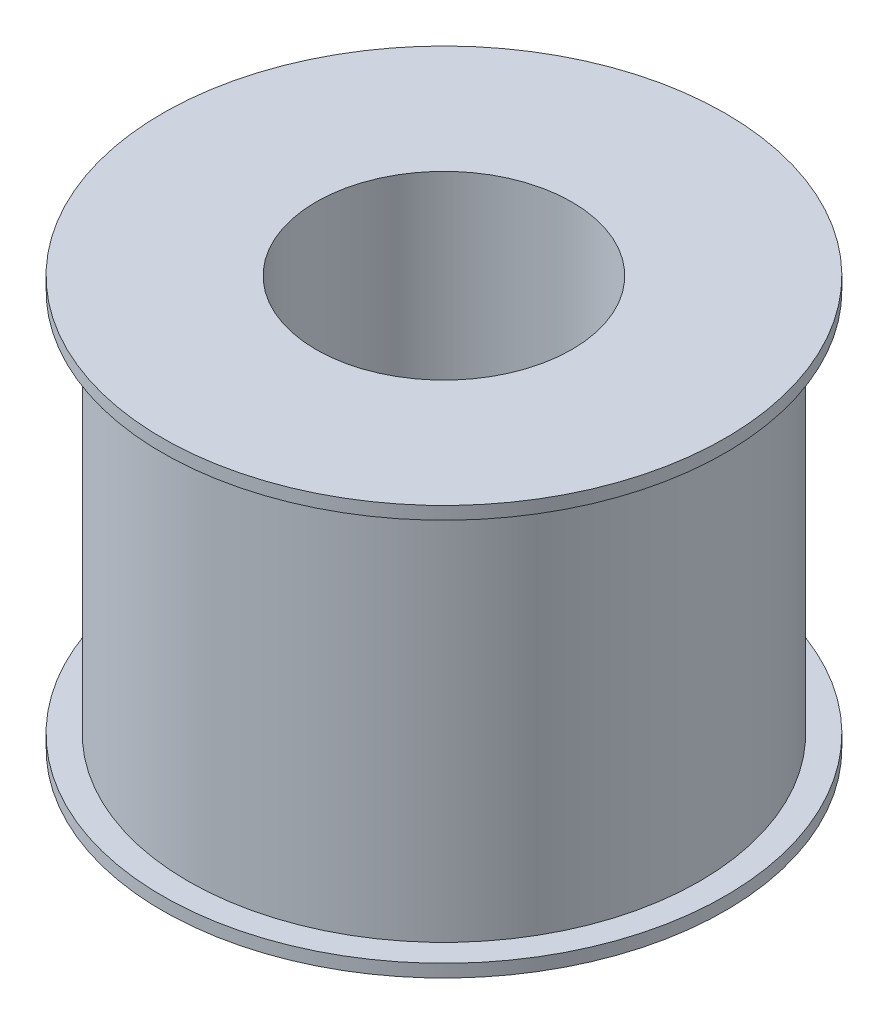
ISO-10303-21;
HEADER;
FILE_DESCRIPTION(('STEP AP214'),'2;1');
FILE_NAME('part.step','',(''),(''),'','','');
FILE_SCHEMA(('AUTOMOTIVE_DESIGN { 1 0 10303 214 1 1 1 1 }'));
ENDSEC;
DATA;
#1=APPLICATION_CONTEXT('core data for automotive mechanical design processes');
#2=APPLICATION_PROTOCOL_DEFINITION('international standard','automotive_design',2000,#1);
#3=PRODUCT_CONTEXT('',#1,'mechanical');
#4=PRODUCT('Part','Part','',(#3));
#5=PRODUCT_RELATED_PRODUCT_CATEGORY('part','',(#4));
#6=PRODUCT_DEFINITION_FORMATION('','',#4);
#7=PRODUCT_DEFINITION_CONTEXT('part definition',#1,'design');
#8=PRODUCT_DEFINITION('design','',#6,#7);
#9=PRODUCT_DEFINITION_SHAPE('','',#8);
#10=(LENGTH_UNIT() NAMED_UNIT(*) SI_UNIT(.MILLI.,.METRE.));
#11=(NAMED_UNIT(*) PLANE_ANGLE_UNIT() SI_UNIT($,.RADIAN.));
#12=(NAMED_UNIT(*) SI_UNIT($,.STERADIAN.) SOLID_ANGLE_UNIT());
#13=UNCERTAINTY_MEASURE_WITH_UNIT(LENGTH_MEASURE(1.E-05),#10,'distance_accuracy_value','');
#14=(GEOMETRIC_REPRESENTATION_CONTEXT(3) GLOBAL_UNCERTAINTY_ASSIGNED_CONTEXT((#13)) GLOBAL_UNIT_ASSIGNED_CONTEXT((#10,
#11,#12)) REPRESENTATION_CONTEXT('',''));
#15=CARTESIAN_POINT('',(0.,0.,0.));
#16=DIRECTION('',(0.,0.,1.));
#17=DIRECTION('',(1.,0.,0.));
#18=AXIS2_PLACEMENT_3D('',#15,#16,#17);
#19=CARTESIAN_POINT('',(0.,0.,0.));
#20=DIRECTION('',(0.,-1.,0.));
#21=DIRECTION('',(0.,0.,-1.));
#22=AXIS2_PLACEMENT_3D('',#19,#20,#21);
#23=CYLINDRICAL_SURFACE('',#22,5.);
#24=CARTESIAN_POINT('',(0.,0.544117647058821,0.));
#25=DIRECTION('',(0.,-1.,0.));
#26=DIRECTION('',(0.,0.,-1.));
#27=AXIS2_PLACEMENT_3D('',#24,#25,#26);
#28=CIRCLE('',#27,5.);
#29=CARTESIAN_POINT('',(0.,0.544117647058821,-5.));
#30=VERTEX_POINT('',#29);
#31=EDGE_CURVE('E64',#30,#30,#28,.T.);
#32=ORIENTED_EDGE('',*,*,#31,.T.);
#33=EDGE_LOOP('',(#32));
#34=FACE_BOUND('',#33,.T.);
#35=CARTESIAN_POINT('',(0.,16.5441176470588,0.));
#36=DIRECTION('',(0.,-1.,0.));
#37=DIRECTION('',(0.,0.,-1.));
#38=AXIS2_PLACEMENT_3D('',#35,#36,#37);
#39=CIRCLE('',#38,5.);
#40=CARTESIAN_POINT('',(0.,16.5441176470588,-5.));
#41=VERTEX_POINT('',#40);
#42=EDGE_CURVE('E10',#41,#41,#39,.T.);
#43=ORIENTED_EDGE('',*,*,#42,.F.);
#44=EDGE_LOOP('',(#43));
#45=FACE_BOUND('',#44,.T.);
#46=ADVANCED_FACE('F36',(#34,#45),#23,.F.);
#47=CARTESIAN_POINT('',(5.,16.5441176470588,0.));
#48=DIRECTION('',(0.,1.,0.));
#49=DIRECTION('',(0.,0.,1.));
#50=AXIS2_PLACEMENT_3D('',#47,#48,#49);
#51=PLANE('',#50);
#52=ORIENTED_EDGE('',*,*,#42,.T.);
#53=EDGE_LOOP('',(#52));
#54=FACE_BOUND('',#53,.T.);
#55=CARTESIAN_POINT('',(0.,16.5441176470588,0.));
#56=DIRECTION('',(0.,-1.,0.));
#57=DIRECTION('',(0.,0.,-1.));
#58=AXIS2_PLACEMENT_3D('',#55,#56,#57);
#59=CIRCLE('',#58,11.);
#60=CARTESIAN_POINT('',(0.,16.5441176470588,-11.));
#61=VERTEX_POINT('',#60);
#62=EDGE_CURVE('E42',#61,#61,#59,.T.);
#63=ORIENTED_EDGE('',*,*,#62,.F.);
#64=EDGE_LOOP('',(#63));
#65=FACE_BOUND('',#64,.T.);
#66=ADVANCED_FACE('F82',(#54,#65),#51,.T.);
#67=CARTESIAN_POINT('',(0.,0.,0.));
#68=DIRECTION('',(0.,-1.,0.));
#69=DIRECTION('',(0.,0.,-1.));
#70=AXIS2_PLACEMENT_3D('',#67,#68,#69);
#71=CYLINDRICAL_SURFACE('',#70,11.);
#72=ORIENTED_EDGE('',*,*,#62,.T.);
#73=EDGE_LOOP('',(#72));
#74=FACE_BOUND('',#73,.T.);
#75=CARTESIAN_POINT('',(0.,16.0441176470588,0.));
#76=DIRECTION('',(0.,-1.,0.));
#77=DIRECTION('',(0.,0.,-1.));
#78=AXIS2_PLACEMENT_3D('',#75,#76,#77);
#79=CIRCLE('',#78,11.);
#80=CARTESIAN_POINT('',(0.,16.0441176470588,-11.));
#81=VERTEX_POINT('',#80);
#82=EDGE_CURVE('E46',#81,#81,#79,.T.);
#83=ORIENTED_EDGE('',*,*,#82,.F.);
#84=EDGE_LOOP('',(#83));
#85=FACE_BOUND('',#84,.T.);
#86=ADVANCED_FACE('F86',(#74,#85),#71,.T.);
#87=CARTESIAN_POINT('',(11.,16.0441176470588,0.));
#88=DIRECTION('',(0.,-1.,0.));
#89=DIRECTION('',(0.,0.,-1.));
#90=AXIS2_PLACEMENT_3D('',#87,#88,#89);
#91=PLANE('',#90);
#92=ORIENTED_EDGE('',*,*,#82,.T.);
#93=EDGE_LOOP('',(#92));
#94=FACE_BOUND('',#93,.T.);
#95=CARTESIAN_POINT('',(0.,16.0441176470588,0.));
#96=DIRECTION('',(0.,-1.,0.));
#97=DIRECTION('',(0.,0.,-1.));
#98=AXIS2_PLACEMENT_3D('',#95,#96,#97);
#99=CIRCLE('',#98,10.);
#100=CARTESIAN_POINT('',(0.,16.0441176470588,-10.));
#101=VERTEX_POINT('',#100);
#102=EDGE_CURVE('E50',#101,#101,#99,.T.);
#103=ORIENTED_EDGE('',*,*,#102,.F.);
#104=EDGE_LOOP('',(#103));
#105=FACE_BOUND('',#104,.T.);
#106=ADVANCED_FACE('F90',(#94,#105),#91,.T.);
#107=CARTESIAN_POINT('',(0.,0.,0.));
#108=DIRECTION('',(0.,-1.,0.));
#109=DIRECTION('',(0.,0.,-1.));
#110=AXIS2_PLACEMENT_3D('',#107,#108,#109);
#111=CYLINDRICAL_SURFACE('',#110,10.);
#112=ORIENTED_EDGE('',*,*,#102,.T.);
#113=EDGE_LOOP('',(#112));
#114=FACE_BOUND('',#113,.T.);
#115=CARTESIAN_POINT('',(0.,1.04411764705882,0.));
#116=DIRECTION('',(0.,-1.,0.));
#117=DIRECTION('',(0.,0.,-1.));
#118=AXIS2_PLACEMENT_3D('',#115,#116,#117);
#119=CIRCLE('',#118,10.);
#120=CARTESIAN_POINT('',(0.,1.04411764705882,-10.));
#121=VERTEX_POINT('',#120);
#122=EDGE_CURVE('E55',#121,#121,#119,.T.);
#123=ORIENTED_EDGE('',*,*,#122,.F.);
#124=EDGE_LOOP('',(#123));
#125=FACE_BOUND('',#124,.T.);
#126=ADVANCED_FACE('F96',(#114,#125),#111,.T.);
#127=CARTESIAN_POINT('',(10.,1.04411764705882,0.));
#128=DIRECTION('',(0.,1.,0.));
#129=DIRECTION('',(0.,0.,1.));
#130=AXIS2_PLACEMENT_3D('',#127,#128,#129);
#131=PLANE('',#130);
#132=ORIENTED_EDGE('',*,*,#122,.T.);
#133=EDGE_LOOP('',(#132));
#134=FACE_BOUND('',#133,.T.);
#135=CARTESIAN_POINT('',(0.,1.04411764705882,0.));
#136=DIRECTION('',(0.,-1.,0.));
#137=DIRECTION('',(0.,0.,-1.));
#138=AXIS2_PLACEMENT_3D('',#135,#136,#137);
#139=CIRCLE('',#138,11.);
#140=CARTESIAN_POINT('',(0.,1.04411764705882,-11.));
#141=VERTEX_POINT('',#140);
#142=EDGE_CURVE('E58',#141,#141,#139,.T.);
#143=ORIENTED_EDGE('',*,*,#142,.F.);
#144=EDGE_LOOP('',(#143));
#145=FACE_BOUND('',#144,.T.);
#146=ADVANCED_FACE('F78',(#134,#145),#131,.T.);
#147=CARTESIAN_POINT('',(0.,0.,0.));
#148=DIRECTION('',(0.,-1.,0.));
#149=DIRECTION('',(0.,0.,-1.));
#150=AXIS2_PLACEMENT_3D('',#147,#148,#149);
#151=CYLINDRICAL_SURFACE('',#150,11.);
#152=ORIENTED_EDGE('',*,*,#142,.T.);
#153=EDGE_LOOP('',(#152));
#154=FACE_BOUND('',#153,.T.);
#155=CARTESIAN_POINT('',(0.,0.54411764705882,0.));
#156=DIRECTION('',(0.,-1.,0.));
#157=DIRECTION('',(0.,0.,-1.));
#158=AXIS2_PLACEMENT_3D('',#155,#156,#157);
#159=CIRCLE('',#158,11.);
#160=CARTESIAN_POINT('',(0.,0.54411764705882,-11.));
#161=VERTEX_POINT('',#160);
#162=EDGE_CURVE('E61',#161,#161,#159,.T.);
#163=ORIENTED_EDGE('',*,*,#162,.F.);
#164=EDGE_LOOP('',(#163));
#165=FACE_BOUND('',#164,.T.);
#166=ADVANCED_FACE('F72',(#154,#165),#151,.T.);
#167=CARTESIAN_POINT('',(11.,0.54411764705882,0.));
#168=DIRECTION('',(0.,-1.,0.));
#169=DIRECTION('',(0.,0.,-1.));
#170=AXIS2_PLACEMENT_3D('',#167,#168,#169);
#171=PLANE('',#170);
#172=ORIENTED_EDGE('',*,*,#162,.T.);
#173=EDGE_LOOP('',(#172));
#174=FACE_BOUND('',#173,.T.);
#175=ORIENTED_EDGE('',*,*,#31,.F.);
#176=EDGE_LOOP('',(#175));
#177=FACE_BOUND('',#176,.T.);
#178=ADVANCED_FACE('F70',(#174,#177),#171,.T.);
#179=CLOSED_SHELL('',(#46,#66,#86,#106,#126,#146,#166,#178));
#180=MANIFOLD_SOLID_BREP('B2',#179);
#181=ADVANCED_BREP_SHAPE_REPRESENTATION('',(#18,#180),#14);
#182=SHAPE_DEFINITION_REPRESENTATION(#9,#181);
ENDSEC;
END-ISO-10303-21;
